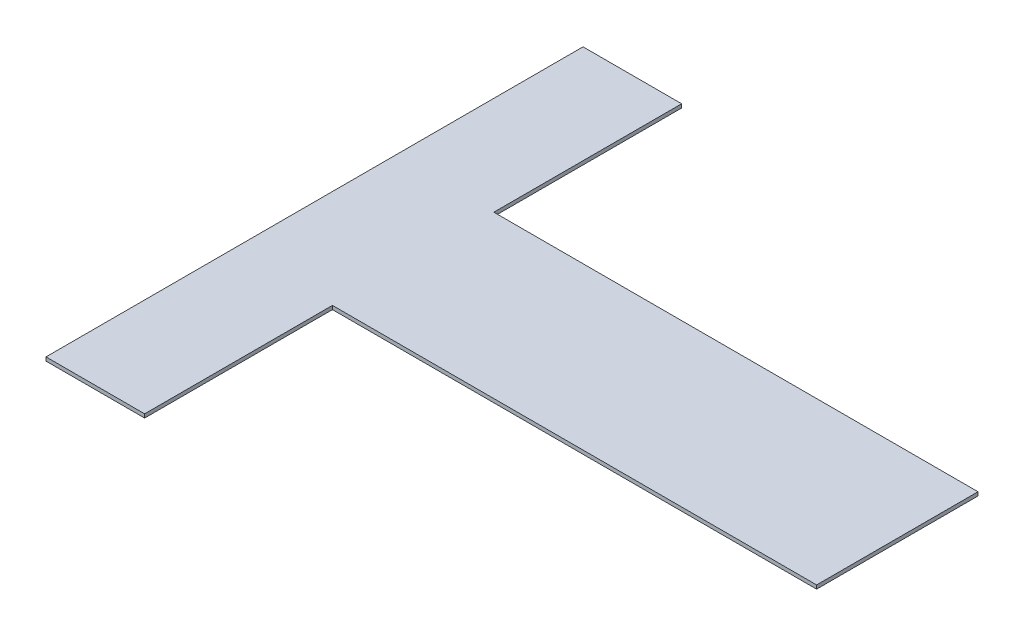
ISO-10303-21;
HEADER;
FILE_DESCRIPTION(('STEP AP214'),'2;1');
FILE_NAME('part.step','',(''),(''),'','','');
FILE_SCHEMA(('AUTOMOTIVE_DESIGN { 1 0 10303 214 1 1 1 1 }'));
ENDSEC;
DATA;
#1=APPLICATION_CONTEXT('core data for automotive mechanical design processes');
#2=APPLICATION_PROTOCOL_DEFINITION('international standard','automotive_design',2000,#1);
#3=PRODUCT_CONTEXT('',#1,'mechanical');
#4=PRODUCT('Part','Part','',(#3));
#5=PRODUCT_RELATED_PRODUCT_CATEGORY('part','',(#4));
#6=PRODUCT_DEFINITION_FORMATION('','',#4);
#7=PRODUCT_DEFINITION_CONTEXT('part definition',#1,'design');
#8=PRODUCT_DEFINITION('design','',#6,#7);
#9=PRODUCT_DEFINITION_SHAPE('','',#8);
#10=(LENGTH_UNIT() NAMED_UNIT(*) SI_UNIT(.MILLI.,.METRE.));
#11=(NAMED_UNIT(*) PLANE_ANGLE_UNIT() SI_UNIT($,.RADIAN.));
#12=(NAMED_UNIT(*) SI_UNIT($,.STERADIAN.) SOLID_ANGLE_UNIT());
#13=UNCERTAINTY_MEASURE_WITH_UNIT(LENGTH_MEASURE(1.E-05),#10,'distance_accuracy_value','');
#14=(GEOMETRIC_REPRESENTATION_CONTEXT(3) GLOBAL_UNCERTAINTY_ASSIGNED_CONTEXT((#13)) GLOBAL_UNIT_ASSIGNED_CONTEXT((#10,
#11,#12)) REPRESENTATION_CONTEXT('',''));
#15=CARTESIAN_POINT('',(0.,0.,0.));
#16=DIRECTION('',(0.,0.,1.));
#17=DIRECTION('',(1.,0.,0.));
#18=AXIS2_PLACEMENT_3D('',#15,#16,#17);
#19=CARTESIAN_POINT('',(0.,-0.126,-2.257313603021));
#20=DIRECTION('',(0.,-1.,0.));
#21=DIRECTION('',(0.,0.,-1.));
#22=AXIS2_PLACEMENT_3D('',#19,#20,#21);
#23=PLANE('',#22);
#24=DIRECTION('',(-1.,0.,0.));
#25=VECTOR('',#24,1.);
#26=CARTESIAN_POINT('',(0.,-0.126,0.2404166084023));
#27=LINE('',#26,#25);
#28=CARTESIAN_POINT('',(0.771336618624,-0.126,0.2404166084023));
#29=VERTEX_POINT('',#28);
#30=CARTESIAN_POINT('',(-0.6711630317898,-0.126,0.2404166084023));
#31=VERTEX_POINT('',#30);
#32=EDGE_CURVE('E92',#29,#31,#27,.T.);
#33=ORIENTED_EDGE('',*,*,#32,.T.);
#34=DIRECTION('',(0.,0.,1.));
#35=VECTOR('',#34,1.);
#36=CARTESIAN_POINT('',(-0.6711630317898,-0.126,-2.257313603021));
#37=LINE('',#36,#35);
#38=CARTESIAN_POINT('',(-0.6711630317898,-0.126,0.8));
#39=VERTEX_POINT('',#38);
#40=EDGE_CURVE('E19',#31,#39,#37,.T.);
#41=ORIENTED_EDGE('',*,*,#40,.T.);
#42=DIRECTION('',(1.,0.,0.));
#43=VECTOR('',#42,1.);
#44=CARTESIAN_POINT('',(0.,-0.126,0.8));
#45=LINE('',#44,#43);
#46=CARTESIAN_POINT('',(-0.9650055531704,-0.126,0.8));
#47=VERTEX_POINT('',#46);
#48=EDGE_CURVE('E82',#47,#39,#45,.T.);
#49=ORIENTED_EDGE('',*,*,#48,.F.);
#50=DIRECTION('',(0.,0.,1.));
#51=VECTOR('',#50,1.);
#52=CARTESIAN_POINT('',(-0.9650055531704,-0.126,-2.257313603021));
#53=LINE('',#52,#51);
#54=CARTESIAN_POINT('',(-0.9650055531704,-0.126,-0.8));
#55=VERTEX_POINT('',#54);
#56=EDGE_CURVE('E77',#55,#47,#53,.T.);
#57=ORIENTED_EDGE('',*,*,#56,.F.);
#58=DIRECTION('',(1.,0.,0.));
#59=VECTOR('',#58,1.);
#60=CARTESIAN_POINT('',(0.,-0.126,-0.8));
#61=LINE('',#60,#59);
#62=CARTESIAN_POINT('',(-0.6711630317898,-0.126,-0.8));
#63=VERTEX_POINT('',#62);
#64=EDGE_CURVE('E105',#55,#63,#61,.T.);
#65=ORIENTED_EDGE('',*,*,#64,.T.);
#66=DIRECTION('',(0.,0.,1.));
#67=VECTOR('',#66,1.);
#68=CARTESIAN_POINT('',(-0.6711630317898,-0.126,-2.257313603021));
#69=LINE('',#68,#67);
#70=CARTESIAN_POINT('',(-0.6711630317898,-0.126,-0.2404166084023));
#71=VERTEX_POINT('',#70);
#72=EDGE_CURVE('E110',#63,#71,#69,.T.);
#73=ORIENTED_EDGE('',*,*,#72,.T.);
#74=DIRECTION('',(-1.,0.,0.));
#75=VECTOR('',#74,1.);
#76=CARTESIAN_POINT('',(0.,-0.126,-0.2404166084023));
#77=LINE('',#76,#75);
#78=CARTESIAN_POINT('',(0.771336618624,-0.126,-0.2404166084023));
#79=VERTEX_POINT('',#78);
#80=EDGE_CURVE('E113',#79,#71,#77,.T.);
#81=ORIENTED_EDGE('',*,*,#80,.F.);
#82=DIRECTION('',(0.,0.,1.));
#83=VECTOR('',#82,1.);
#84=CARTESIAN_POINT('',(0.771336618624,-0.126,-2.257313603021));
#85=LINE('',#84,#83);
#86=EDGE_CURVE('E120',#79,#29,#85,.T.);
#87=ORIENTED_EDGE('',*,*,#86,.T.);
#88=EDGE_LOOP('',(#33,#41,#49,#57,#65,#73,#81,#87));
#89=FACE_BOUND('',#88,.T.);
#90=ADVANCED_FACE('F16',(#89),#23,.T.);
#91=CARTESIAN_POINT('',(-0.6711630317898,-0.115,-2.257313603021));
#92=DIRECTION('',(-1.,0.,0.));
#93=DIRECTION('',(0.,0.,1.));
#94=AXIS2_PLACEMENT_3D('',#91,#92,#93);
#95=PLANE('',#94);
#96=DIRECTION('',(0.,1.,0.));
#97=VECTOR('',#96,1.);
#98=CARTESIAN_POINT('',(-0.6711630317898,-0.115,0.2404166084023));
#99=LINE('',#98,#97);
#100=CARTESIAN_POINT('',(-0.6711630317898,-0.115,0.2404166084023));
#101=VERTEX_POINT('',#100);
#102=EDGE_CURVE('E122',#31,#101,#99,.T.);
#103=ORIENTED_EDGE('',*,*,#102,.T.);
#104=DIRECTION('',(0.,0.,-1.));
#105=VECTOR('',#104,1.);
#106=CARTESIAN_POINT('',(-0.6711630317898,-0.115,-2.257313603021));
#107=LINE('',#106,#105);
#108=CARTESIAN_POINT('',(-0.6711630317898,-0.115,0.8));
#109=VERTEX_POINT('',#108);
#110=EDGE_CURVE('E98',#101,#109,#107,.F.);
#111=ORIENTED_EDGE('',*,*,#110,.T.);
#112=DIRECTION('',(0.,1.,0.));
#113=VECTOR('',#112,1.);
#114=CARTESIAN_POINT('',(-0.6711630317898,-0.115,0.8));
#115=LINE('',#114,#113);
#116=EDGE_CURVE('E87',#39,#109,#115,.T.);
#117=ORIENTED_EDGE('',*,*,#116,.F.);
#118=ORIENTED_EDGE('',*,*,#40,.F.);
#119=EDGE_LOOP('',(#103,#111,#117,#118));
#120=FACE_BOUND('',#119,.T.);
#121=ADVANCED_FACE('F97',(#120),#95,.F.);
#122=CARTESIAN_POINT('',(0.,-0.115,0.8));
#123=DIRECTION('',(0.,0.,1.));
#124=DIRECTION('',(1.,0.,0.));
#125=AXIS2_PLACEMENT_3D('',#122,#123,#124);
#126=PLANE('',#125);
#127=DIRECTION('',(1.,0.,0.));
#128=VECTOR('',#127,1.);
#129=CARTESIAN_POINT('',(0.,-0.115,0.8));
#130=LINE('',#129,#128);
#131=CARTESIAN_POINT('',(-0.9650055531704,-0.115,0.8));
#132=VERTEX_POINT('',#131);
#133=EDGE_CURVE('E127',#109,#132,#130,.F.);
#134=ORIENTED_EDGE('',*,*,#133,.T.);
#135=DIRECTION('',(0.,1.,0.));
#136=VECTOR('',#135,1.);
#137=CARTESIAN_POINT('',(-0.9650055531704,-0.115,0.8));
#138=LINE('',#137,#136);
#139=EDGE_CURVE('E89',#47,#132,#138,.T.);
#140=ORIENTED_EDGE('',*,*,#139,.F.);
#141=ORIENTED_EDGE('',*,*,#48,.T.);
#142=ORIENTED_EDGE('',*,*,#116,.T.);
#143=EDGE_LOOP('',(#134,#140,#141,#142));
#144=FACE_BOUND('',#143,.T.);
#145=ADVANCED_FACE('F85',(#144),#126,.T.);
#146=CARTESIAN_POINT('',(-0.9650055531704,-0.115,-2.257313603021));
#147=DIRECTION('',(-1.,0.,0.));
#148=DIRECTION('',(0.,0.,1.));
#149=AXIS2_PLACEMENT_3D('',#146,#147,#148);
#150=PLANE('',#149);
#151=DIRECTION('',(0.,0.,-1.));
#152=VECTOR('',#151,1.);
#153=CARTESIAN_POINT('',(-0.9650055531704,-0.115,-2.257313603021));
#154=LINE('',#153,#152);
#155=CARTESIAN_POINT('',(-0.9650055531704,-0.115,-0.8));
#156=VERTEX_POINT('',#155);
#157=EDGE_CURVE('E129',#132,#156,#154,.T.);
#158=ORIENTED_EDGE('',*,*,#157,.T.);
#159=DIRECTION('',(0.,1.,0.));
#160=VECTOR('',#159,1.);
#161=CARTESIAN_POINT('',(-0.9650055531704,-0.115,-0.8));
#162=LINE('',#161,#160);
#163=EDGE_CURVE('E103',#156,#55,#162,.F.);
#164=ORIENTED_EDGE('',*,*,#163,.T.);
#165=ORIENTED_EDGE('',*,*,#56,.T.);
#166=ORIENTED_EDGE('',*,*,#139,.T.);
#167=EDGE_LOOP('',(#158,#164,#165,#166));
#168=FACE_BOUND('',#167,.T.);
#169=ADVANCED_FACE('F161',(#168),#150,.T.);
#170=CARTESIAN_POINT('',(0.,-0.115,-0.8));
#171=DIRECTION('',(0.,0.,1.));
#172=DIRECTION('',(1.,0.,0.));
#173=AXIS2_PLACEMENT_3D('',#170,#171,#172);
#174=PLANE('',#173);
#175=ORIENTED_EDGE('',*,*,#163,.F.);
#176=DIRECTION('',(1.,0.,0.));
#177=VECTOR('',#176,1.);
#178=CARTESIAN_POINT('',(0.,-0.115,-0.8));
#179=LINE('',#178,#177);
#180=CARTESIAN_POINT('',(-0.6711630317898,-0.115,-0.8));
#181=VERTEX_POINT('',#180);
#182=EDGE_CURVE('E132',#156,#181,#179,.T.);
#183=ORIENTED_EDGE('',*,*,#182,.T.);
#184=DIRECTION('',(0.,1.,0.));
#185=VECTOR('',#184,1.);
#186=CARTESIAN_POINT('',(-0.6711630317898,-0.115,-0.8));
#187=LINE('',#186,#185);
#188=EDGE_CURVE('E107',#181,#63,#187,.F.);
#189=ORIENTED_EDGE('',*,*,#188,.T.);
#190=ORIENTED_EDGE('',*,*,#64,.F.);
#191=EDGE_LOOP('',(#175,#183,#189,#190));
#192=FACE_BOUND('',#191,.T.);
#193=ADVANCED_FACE('F159',(#192),#174,.F.);
#194=CARTESIAN_POINT('',(-0.6711630317898,-0.115,-2.257313603021));
#195=DIRECTION('',(-1.,0.,0.));
#196=DIRECTION('',(0.,0.,1.));
#197=AXIS2_PLACEMENT_3D('',#194,#195,#196);
#198=PLANE('',#197);
#199=ORIENTED_EDGE('',*,*,#188,.F.);
#200=DIRECTION('',(0.,0.,-1.));
#201=VECTOR('',#200,1.);
#202=CARTESIAN_POINT('',(-0.6711630317898,-0.115,-2.257313603021));
#203=LINE('',#202,#201);
#204=CARTESIAN_POINT('',(-0.6711630317898,-0.115,-0.2404166084023));
#205=VERTEX_POINT('',#204);
#206=EDGE_CURVE('E135',#181,#205,#203,.F.);
#207=ORIENTED_EDGE('',*,*,#206,.T.);
#208=DIRECTION('',(0.,1.,0.));
#209=VECTOR('',#208,1.);
#210=CARTESIAN_POINT('',(-0.6711630317898,-0.115,-0.2404166084023));
#211=LINE('',#210,#209);
#212=EDGE_CURVE('E115',#71,#205,#211,.T.);
#213=ORIENTED_EDGE('',*,*,#212,.F.);
#214=ORIENTED_EDGE('',*,*,#72,.F.);
#215=EDGE_LOOP('',(#199,#207,#213,#214));
#216=FACE_BOUND('',#215,.T.);
#217=ADVANCED_FACE('F155',(#216),#198,.F.);
#218=CARTESIAN_POINT('',(0.,-0.115,-0.2404166084023));
#219=DIRECTION('',(0.,0.,-1.));
#220=DIRECTION('',(-1.,0.,0.));
#221=AXIS2_PLACEMENT_3D('',#218,#219,#220);
#222=PLANE('',#221);
#223=DIRECTION('',(1.,0.,0.));
#224=VECTOR('',#223,1.);
#225=CARTESIAN_POINT('',(0.,-0.115,-0.2404166084023));
#226=LINE('',#225,#224);
#227=CARTESIAN_POINT('',(0.771336618624,-0.115,-0.2404166084023));
#228=VERTEX_POINT('',#227);
#229=EDGE_CURVE('E138',#205,#228,#226,.T.);
#230=ORIENTED_EDGE('',*,*,#229,.T.);
#231=DIRECTION('',(0.,1.,0.));
#232=VECTOR('',#231,1.);
#233=CARTESIAN_POINT('',(0.771336618624,-0.115,-0.2404166084023));
#234=LINE('',#233,#232);
#235=EDGE_CURVE('E117',#228,#79,#234,.F.);
#236=ORIENTED_EDGE('',*,*,#235,.T.);
#237=ORIENTED_EDGE('',*,*,#80,.T.);
#238=ORIENTED_EDGE('',*,*,#212,.T.);
#239=EDGE_LOOP('',(#230,#236,#237,#238));
#240=FACE_BOUND('',#239,.T.);
#241=ADVANCED_FACE('F151',(#240),#222,.T.);
#242=CARTESIAN_POINT('',(0.771336618624,-0.115,-2.257313603021));
#243=DIRECTION('',(-1.,0.,0.));
#244=DIRECTION('',(0.,0.,1.));
#245=AXIS2_PLACEMENT_3D('',#242,#243,#244);
#246=PLANE('',#245);
#247=ORIENTED_EDGE('',*,*,#235,.F.);
#248=DIRECTION('',(0.,0.,-1.));
#249=VECTOR('',#248,1.);
#250=CARTESIAN_POINT('',(0.771336618624,-0.115,-2.257313603021));
#251=LINE('',#250,#249);
#252=CARTESIAN_POINT('',(0.771336618624,-0.115,0.2404166084023));
#253=VERTEX_POINT('',#252);
#254=EDGE_CURVE('E25',#228,#253,#251,.F.);
#255=ORIENTED_EDGE('',*,*,#254,.T.);
#256=DIRECTION('',(0.,1.,0.));
#257=VECTOR('',#256,1.);
#258=CARTESIAN_POINT('',(0.771336618624,-0.115,0.2404166084023));
#259=LINE('',#258,#257);
#260=EDGE_CURVE('E33',#253,#29,#259,.F.);
#261=ORIENTED_EDGE('',*,*,#260,.T.);
#262=ORIENTED_EDGE('',*,*,#86,.F.);
#263=EDGE_LOOP('',(#247,#255,#261,#262));
#264=FACE_BOUND('',#263,.T.);
#265=ADVANCED_FACE('F144',(#264),#246,.F.);
#266=CARTESIAN_POINT('',(0.,-0.115,0.2404166084023));
#267=DIRECTION('',(0.,0.,-1.));
#268=DIRECTION('',(-1.,0.,0.));
#269=AXIS2_PLACEMENT_3D('',#266,#267,#268);
#270=PLANE('',#269);
#271=ORIENTED_EDGE('',*,*,#260,.F.);
#272=DIRECTION('',(1.,0.,0.));
#273=VECTOR('',#272,1.);
#274=CARTESIAN_POINT('',(0.,-0.115,0.2404166084023));
#275=LINE('',#274,#273);
#276=EDGE_CURVE('E11',#253,#101,#275,.F.);
#277=ORIENTED_EDGE('',*,*,#276,.T.);
#278=ORIENTED_EDGE('',*,*,#102,.F.);
#279=ORIENTED_EDGE('',*,*,#32,.F.);
#280=EDGE_LOOP('',(#271,#277,#278,#279));
#281=FACE_BOUND('',#280,.T.);
#282=ADVANCED_FACE('F162',(#281),#270,.F.);
#283=CARTESIAN_POINT('',(0.,-0.115,-2.257313603021));
#284=DIRECTION('',(0.,-1.,0.));
#285=DIRECTION('',(0.,0.,-1.));
#286=AXIS2_PLACEMENT_3D('',#283,#284,#285);
#287=PLANE('',#286);
#288=ORIENTED_EDGE('',*,*,#254,.F.);
#289=ORIENTED_EDGE('',*,*,#229,.F.);
#290=ORIENTED_EDGE('',*,*,#206,.F.);
#291=ORIENTED_EDGE('',*,*,#182,.F.);
#292=ORIENTED_EDGE('',*,*,#157,.F.);
#293=ORIENTED_EDGE('',*,*,#133,.F.);
#294=ORIENTED_EDGE('',*,*,#110,.F.);
#295=ORIENTED_EDGE('',*,*,#276,.F.);
#296=EDGE_LOOP('',(#288,#289,#290,#291,#292,#293,#294,#295));
#297=FACE_BOUND('',#296,.T.);
#298=ADVANCED_FACE('F148',(#297),#287,.F.);
#299=CLOSED_SHELL('',(#90,#121,#145,#169,#193,#217,#241,#265,#282,#298));
#300=MANIFOLD_SOLID_BREP('B1',#299);
#301=ADVANCED_BREP_SHAPE_REPRESENTATION('',(#18,#300),#14);
#302=SHAPE_DEFINITION_REPRESENTATION(#9,#301);
ENDSEC;
END-ISO-10303-21;
